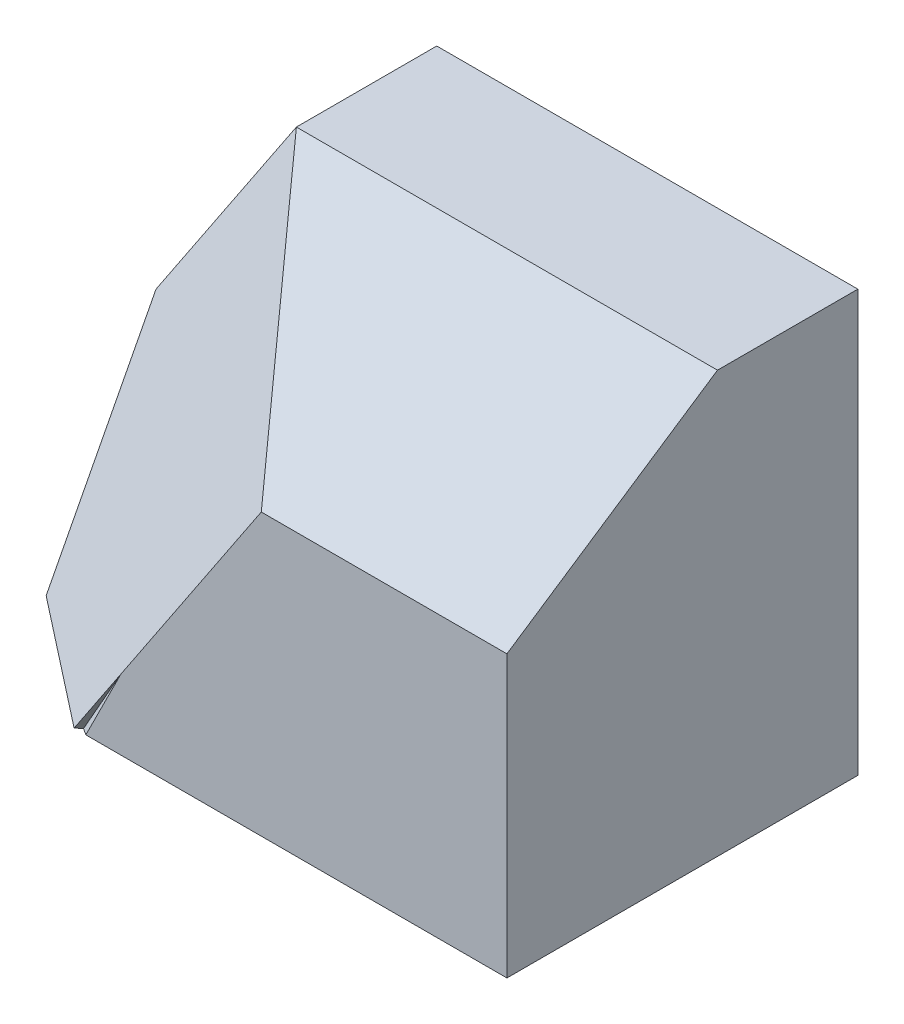
ISO-10303-21;
HEADER;
FILE_DESCRIPTION(('STEP AP214'),'2;1');
FILE_NAME('part.step','',(''),(''),'','','');
FILE_SCHEMA(('AUTOMOTIVE_DESIGN { 1 0 10303 214 1 1 1 1 }'));
ENDSEC;
DATA;
#1=APPLICATION_CONTEXT('core data for automotive mechanical design processes');
#2=APPLICATION_PROTOCOL_DEFINITION('international standard','automotive_design',2000,#1);
#3=PRODUCT_CONTEXT('',#1,'mechanical');
#4=PRODUCT('Part','Part','',(#3));
#5=PRODUCT_RELATED_PRODUCT_CATEGORY('part','',(#4));
#6=PRODUCT_DEFINITION_FORMATION('','',#4);
#7=PRODUCT_DEFINITION_CONTEXT('part definition',#1,'design');
#8=PRODUCT_DEFINITION('design','',#6,#7);
#9=PRODUCT_DEFINITION_SHAPE('','',#8);
#10=(LENGTH_UNIT() NAMED_UNIT(*) SI_UNIT(.MILLI.,.METRE.));
#11=(NAMED_UNIT(*) PLANE_ANGLE_UNIT() SI_UNIT($,.RADIAN.));
#12=(NAMED_UNIT(*) SI_UNIT($,.STERADIAN.) SOLID_ANGLE_UNIT());
#13=UNCERTAINTY_MEASURE_WITH_UNIT(LENGTH_MEASURE(1.E-05),#10,'distance_accuracy_value','');
#14=(GEOMETRIC_REPRESENTATION_CONTEXT(3) GLOBAL_UNCERTAINTY_ASSIGNED_CONTEXT((#13)) GLOBAL_UNIT_ASSIGNED_CONTEXT((#10,
#11,#12)) REPRESENTATION_CONTEXT('',''));
#15=CARTESIAN_POINT('',(0.,0.,0.));
#16=DIRECTION('',(0.,0.,1.));
#17=DIRECTION('',(1.,0.,0.));
#18=AXIS2_PLACEMENT_3D('',#15,#16,#17);
#19=CARTESIAN_POINT('',(21.1836619318213,-1.90021906565861,46.3579134574877));
#20=DIRECTION('',(0.606079835940257,-0.404053223960172,0.685133727584639));
#21=DIRECTION('',(0.74899656249038,0.,-0.662573882203029));
#22=AXIS2_PLACEMENT_3D('',#19,#20,#21);
#23=PLANE('',#22);
#24=DIRECTION('',(0.554700196225229,0.832050294337844,0.));
#25=VECTOR('',#24,1.);
#26=CARTESIAN_POINT('',(18.3333333333333,0.,50.));
#27=LINE('',#26,#25);
#28=CARTESIAN_POINT('',(18.3333333333333,0.,50.));
#29=VERTEX_POINT('',#28);
#30=CARTESIAN_POINT('',(24.9999999999999,9.9999999999998,50.));
#31=VERTEX_POINT('',#30);
#32=EDGE_CURVE('E156',#29,#31,#27,.T.);
#33=ORIENTED_EDGE('',*,*,#32,.F.);
#34=DIRECTION('',(0.74899656249038,0.,-0.662573882203029));
#35=VECTOR('',#34,1.);
#36=CARTESIAN_POINT('',(21.7397979681883,0.,46.9865889768591));
#37=LINE('',#36,#35);
#38=CARTESIAN_POINT('',(19.0495867768595,0.,49.366391184573));
#39=VERTEX_POINT('',#38);
#40=EDGE_CURVE('E158',#29,#39,#37,.T.);
#41=ORIENTED_EDGE('',*,*,#40,.T.);
#42=DIRECTION('',(0.510602628361373,0.858096083773975,0.0543697243162574));
#43=VECTOR('',#42,1.);
#44=CARTESIAN_POINT('',(12.7125965331873,-10.6496641595047,48.6916190752931));
#45=LINE('',#44,#43);
#46=EDGE_CURVE('E153',#39,#31,#45,.T.);
#47=ORIENTED_EDGE('',*,*,#46,.T.);
#48=EDGE_LOOP('',(#33,#41,#47));
#49=FACE_BOUND('',#48,.T.);
#50=ADVANCED_FACE('F35',(#49),#23,.T.);
#51=CARTESIAN_POINT('',(0.,0.,50.));
#52=DIRECTION('',(1.,0.,0.));
#53=DIRECTION('',(0.,0.,-1.));
#54=AXIS2_PLACEMENT_3D('',#51,#52,#53);
#55=PLANE('',#54);
#56=DIRECTION('',(0.,0.,-1.));
#57=VECTOR('',#56,1.);
#58=CARTESIAN_POINT('',(0.,0.,50.));
#59=LINE('',#58,#57);
#60=CARTESIAN_POINT('',(0.,0.,35.6521739130435));
#61=VERTEX_POINT('',#60);
#62=CARTESIAN_POINT('',(0.,0.,0.));
#63=VERTEX_POINT('',#62);
#64=EDGE_CURVE('E130',#61,#63,#59,.T.);
#65=ORIENTED_EDGE('',*,*,#64,.F.);
#66=DIRECTION('',(0.,0.886584846165455,-0.46256600669502));
#67=VECTOR('',#66,1.);
#68=CARTESIAN_POINT('',(0.,-5.88410104011887,38.7221396731055));
#69=LINE('',#68,#67);
#70=CARTESIAN_POINT('',(0.,30.,20.));
#71=VERTEX_POINT('',#70);
#72=EDGE_CURVE('E147',#61,#71,#69,.T.);
#73=ORIENTED_EDGE('',*,*,#72,.T.);
#74=DIRECTION('',(0.,0.,1.));
#75=VECTOR('',#74,1.);
#76=CARTESIAN_POINT('',(0.,30.,0.));
#77=LINE('',#76,#75);
#78=CARTESIAN_POINT('',(0.,30.,0.));
#79=VERTEX_POINT('',#78);
#80=EDGE_CURVE('E129',#79,#71,#77,.T.);
#81=ORIENTED_EDGE('',*,*,#80,.F.);
#82=DIRECTION('',(0.,-1.,0.));
#83=VECTOR('',#82,1.);
#84=CARTESIAN_POINT('',(0.,0.,0.));
#85=LINE('',#84,#83);
#86=EDGE_CURVE('E107',#79,#63,#85,.T.);
#87=ORIENTED_EDGE('',*,*,#86,.T.);
#88=EDGE_LOOP('',(#65,#73,#81,#87));
#89=FACE_BOUND('',#88,.T.);
#90=ADVANCED_FACE('F185',(#89),#55,.F.);
#91=CARTESIAN_POINT('',(-15.7142857142857,7.85714285714286,23.5714285714286));
#92=DIRECTION('',(-0.534522483824849,0.267261241912424,0.801783725737273));
#93=DIRECTION('',(0.832050294337844,0.,0.554700196225229));
#94=AXIS2_PLACEMENT_3D('',#91,#92,#93);
#95=PLANE('',#94);
#96=ORIENTED_EDGE('',*,*,#46,.F.);
#97=DIRECTION('',(-0.832050294337844,0.,-0.554700196225229));
#98=VECTOR('',#97,1.);
#99=CARTESIAN_POINT('',(6.15384615384614,0.,40.7692307692308));
#100=LINE('',#99,#98);
#101=CARTESIAN_POINT('',(20.,0.,50.));
#102=VERTEX_POINT('',#101);
#103=EDGE_CURVE('E133',#102,#39,#100,.T.);
#104=ORIENTED_EDGE('',*,*,#103,.F.);
#105=DIRECTION('',(-0.447213595499958,-0.894427190999916,0.));
#106=VECTOR('',#105,1.);
#107=CARTESIAN_POINT('',(16.,-7.99999999999999,50.));
#108=LINE('',#107,#106);
#109=EDGE_CURVE('E131',#31,#102,#108,.T.);
#110=ORIENTED_EDGE('',*,*,#109,.F.);
#111=EDGE_LOOP('',(#96,#104,#110));
#112=FACE_BOUND('',#111,.T.);
#113=ADVANCED_FACE('F172',(#112),#95,.T.);
#114=CARTESIAN_POINT('',(0.,0.,50.));
#115=DIRECTION('',(0.,1.,0.));
#116=DIRECTION('',(0.,0.,1.));
#117=AXIS2_PLACEMENT_3D('',#114,#115,#116);
#118=PLANE('',#117);
#119=DIRECTION('',(-0.787505001007586,0.,-0.616308261658111));
#120=VECTOR('',#119,1.);
#121=CARTESIAN_POINT('',(6.96365767878078,0.,41.1019929660023));
#122=LINE('',#121,#120);
#123=EDGE_CURVE('E150',#29,#61,#122,.T.);
#124=ORIENTED_EDGE('',*,*,#123,.T.);
#125=ORIENTED_EDGE('',*,*,#64,.T.);
#126=DIRECTION('',(1.,0.,0.));
#127=VECTOR('',#126,1.);
#128=CARTESIAN_POINT('',(0.,0.,0.));
#129=LINE('',#128,#127);
#130=CARTESIAN_POINT('',(80.,0.,0.));
#131=VERTEX_POINT('',#130);
#132=EDGE_CURVE('E127',#63,#131,#129,.T.);
#133=ORIENTED_EDGE('',*,*,#132,.T.);
#134=DIRECTION('',(0.,0.,-1.));
#135=VECTOR('',#134,1.);
#136=CARTESIAN_POINT('',(80.,0.,50.));
#137=LINE('',#136,#135);
#138=CARTESIAN_POINT('',(80.,0.,50.));
#139=VERTEX_POINT('',#138);
#140=EDGE_CURVE('E118',#139,#131,#137,.T.);
#141=ORIENTED_EDGE('',*,*,#140,.F.);
#142=DIRECTION('',(1.,0.,0.));
#143=VECTOR('',#142,1.);
#144=CARTESIAN_POINT('',(0.,0.,50.));
#145=LINE('',#144,#143);
#146=EDGE_CURVE('E138',#102,#139,#145,.T.);
#147=ORIENTED_EDGE('',*,*,#146,.F.);
#148=ORIENTED_EDGE('',*,*,#103,.T.);
#149=ORIENTED_EDGE('',*,*,#40,.F.);
#150=EDGE_LOOP('',(#124,#125,#133,#141,#147,#148,#149));
#151=FACE_BOUND('',#150,.T.);
#152=ADVANCED_FACE('F174',(#151),#118,.F.);
#153=CARTESIAN_POINT('',(0.,30.,0.));
#154=DIRECTION('',(0.832050294337843,-0.554700196225229,0.));
#155=DIRECTION('',(0.554700196225229,0.832050294337844,0.));
#156=AXIS2_PLACEMENT_3D('',#153,#154,#155);
#157=PLANE('',#156);
#158=ORIENTED_EDGE('',*,*,#80,.T.);
#159=DIRECTION('',(-0.554700196225229,-0.832050294337844,0.));
#160=VECTOR('',#159,1.);
#161=CARTESIAN_POINT('',(0.,30.,20.));
#162=LINE('',#161,#160);
#163=CARTESIAN_POINT('',(20.,60.,20.));
#164=VERTEX_POINT('',#163);
#165=EDGE_CURVE('E94',#164,#71,#162,.T.);
#166=ORIENTED_EDGE('',*,*,#165,.F.);
#167=DIRECTION('',(0.,0.,1.));
#168=VECTOR('',#167,1.);
#169=CARTESIAN_POINT('',(20.,60.,0.));
#170=LINE('',#169,#168);
#171=CARTESIAN_POINT('',(20.,60.,0.));
#172=VERTEX_POINT('',#171);
#173=EDGE_CURVE('E39',#172,#164,#170,.T.);
#174=ORIENTED_EDGE('',*,*,#173,.F.);
#175=DIRECTION('',(0.554700196225229,0.832050294337844,0.));
#176=VECTOR('',#175,1.);
#177=CARTESIAN_POINT('',(0.,30.,0.));
#178=LINE('',#177,#176);
#179=EDGE_CURVE('E44',#79,#172,#178,.T.);
#180=ORIENTED_EDGE('',*,*,#179,.F.);
#181=EDGE_LOOP('',(#158,#166,#174,#180));
#182=FACE_BOUND('',#181,.T.);
#183=ADVANCED_FACE('F37',(#182),#157,.F.);
#184=CARTESIAN_POINT('',(0.,0.,50.));
#185=DIRECTION('',(0.,0.,-1.));
#186=DIRECTION('',(-1.,0.,0.));
#187=AXIS2_PLACEMENT_3D('',#184,#185,#186);
#188=PLANE('',#187);
#189=DIRECTION('',(1.,0.,0.));
#190=VECTOR('',#189,1.);
#191=CARTESIAN_POINT('',(-44.,40.,50.));
#192=LINE('',#191,#190);
#193=CARTESIAN_POINT('',(45.,40.,50.));
#194=VERTEX_POINT('',#193);
#195=CARTESIAN_POINT('',(80.,40.,50.));
#196=VERTEX_POINT('',#195);
#197=EDGE_CURVE('E11',#194,#196,#192,.T.);
#198=ORIENTED_EDGE('',*,*,#197,.F.);
#199=DIRECTION('',(0.554700196225229,0.832050294337844,0.));
#200=VECTOR('',#199,1.);
#201=CARTESIAN_POINT('',(45.,40.,50.));
#202=LINE('',#201,#200);
#203=EDGE_CURVE('E52',#31,#194,#202,.T.);
#204=ORIENTED_EDGE('',*,*,#203,.F.);
#205=ORIENTED_EDGE('',*,*,#109,.T.);
#206=ORIENTED_EDGE('',*,*,#146,.T.);
#207=DIRECTION('',(0.,1.,0.));
#208=VECTOR('',#207,1.);
#209=CARTESIAN_POINT('',(80.,0.,50.));
#210=LINE('',#209,#208);
#211=EDGE_CURVE('E121',#139,#196,#210,.T.);
#212=ORIENTED_EDGE('',*,*,#211,.T.);
#213=EDGE_LOOP('',(#198,#204,#205,#206,#212));
#214=FACE_BOUND('',#213,.T.);
#215=ADVANCED_FACE('F177',(#214),#188,.F.);
#216=CARTESIAN_POINT('',(80.,0.,50.));
#217=DIRECTION('',(-1.,0.,0.));
#218=DIRECTION('',(0.,0.,1.));
#219=AXIS2_PLACEMENT_3D('',#216,#217,#218);
#220=PLANE('',#219);
#221=DIRECTION('',(0.,0.,-1.));
#222=VECTOR('',#221,1.);
#223=CARTESIAN_POINT('',(80.,60.,50.));
#224=LINE('',#223,#222);
#225=CARTESIAN_POINT('',(80.,60.,20.));
#226=VERTEX_POINT('',#225);
#227=CARTESIAN_POINT('',(80.,60.,0.));
#228=VERTEX_POINT('',#227);
#229=EDGE_CURVE('E111',#226,#228,#224,.T.);
#230=ORIENTED_EDGE('',*,*,#229,.F.);
#231=DIRECTION('',(0.,-0.554700196225229,0.832050294337844));
#232=VECTOR('',#231,1.);
#233=CARTESIAN_POINT('',(80.,60.,20.));
#234=LINE('',#233,#232);
#235=EDGE_CURVE('E60',#226,#196,#234,.T.);
#236=ORIENTED_EDGE('',*,*,#235,.T.);
#237=ORIENTED_EDGE('',*,*,#211,.F.);
#238=ORIENTED_EDGE('',*,*,#140,.T.);
#239=DIRECTION('',(0.,1.,0.));
#240=VECTOR('',#239,1.);
#241=CARTESIAN_POINT('',(80.,0.,0.));
#242=LINE('',#241,#240);
#243=EDGE_CURVE('E98',#131,#228,#242,.T.);
#244=ORIENTED_EDGE('',*,*,#243,.T.);
#245=EDGE_LOOP('',(#230,#236,#237,#238,#244));
#246=FACE_BOUND('',#245,.T.);
#247=ADVANCED_FACE('F123',(#246),#220,.F.);
#248=CARTESIAN_POINT('',(0.,60.,50.));
#249=DIRECTION('',(0.,-1.,0.));
#250=DIRECTION('',(0.,0.,-1.));
#251=AXIS2_PLACEMENT_3D('',#248,#249,#250);
#252=PLANE('',#251);
#253=ORIENTED_EDGE('',*,*,#173,.T.);
#254=DIRECTION('',(1.,0.,0.));
#255=VECTOR('',#254,1.);
#256=CARTESIAN_POINT('',(20.,60.,20.));
#257=LINE('',#256,#255);
#258=EDGE_CURVE('E97',#164,#226,#257,.T.);
#259=ORIENTED_EDGE('',*,*,#258,.T.);
#260=ORIENTED_EDGE('',*,*,#229,.T.);
#261=DIRECTION('',(-1.,0.,0.));
#262=VECTOR('',#261,1.);
#263=CARTESIAN_POINT('',(0.,60.,0.));
#264=LINE('',#263,#262);
#265=EDGE_CURVE('E104',#228,#172,#264,.T.);
#266=ORIENTED_EDGE('',*,*,#265,.T.);
#267=EDGE_LOOP('',(#253,#259,#260,#266));
#268=FACE_BOUND('',#267,.T.);
#269=ADVANCED_FACE('F109',(#268),#252,.F.);
#270=CARTESIAN_POINT('',(0.,0.,0.));
#271=DIRECTION('',(0.,0.,-1.));
#272=DIRECTION('',(-1.,0.,0.));
#273=AXIS2_PLACEMENT_3D('',#270,#271,#272);
#274=PLANE('',#273);
#275=ORIENTED_EDGE('',*,*,#179,.T.);
#276=ORIENTED_EDGE('',*,*,#265,.F.);
#277=ORIENTED_EDGE('',*,*,#243,.F.);
#278=ORIENTED_EDGE('',*,*,#132,.F.);
#279=ORIENTED_EDGE('',*,*,#86,.F.);
#280=EDGE_LOOP('',(#275,#276,#277,#278,#279));
#281=FACE_BOUND('',#280,.T.);
#282=ADVANCED_FACE('F102',(#281),#274,.T.);
#283=CARTESIAN_POINT('',(0.,50.7692307692308,33.8461538461539));
#284=DIRECTION('',(0.,-0.832050294337843,-0.554700196225229));
#285=DIRECTION('',(0.,0.554700196225229,-0.832050294337843));
#286=AXIS2_PLACEMENT_3D('',#283,#284,#285);
#287=PLANE('',#286);
#288=ORIENTED_EDGE('',*,*,#258,.F.);
#289=DIRECTION('',(-0.56980288229819,0.455842305838552,-0.683763458757828));
#290=VECTOR('',#289,1.);
#291=CARTESIAN_POINT('',(20.,60.,20.));
#292=LINE('',#291,#290);
#293=EDGE_CURVE('E137',#194,#164,#292,.T.);
#294=ORIENTED_EDGE('',*,*,#293,.F.);
#295=ORIENTED_EDGE('',*,*,#197,.T.);
#296=ORIENTED_EDGE('',*,*,#235,.F.);
#297=EDGE_LOOP('',(#288,#294,#295,#296));
#298=FACE_BOUND('',#297,.T.);
#299=ADVANCED_FACE('F188',(#298),#287,.F.);
#300=CARTESIAN_POINT('',(-14.8044132397192,9.86960882647943,18.9167502507523));
#301=DIRECTION('',(0.570065719697583,-0.380043813131722,-0.728417308502467));
#302=DIRECTION('',(-0.787505001007586,0.,-0.61630826165811));
#303=AXIS2_PLACEMENT_3D('',#300,#301,#302);
#304=PLANE('',#303);
#305=ORIENTED_EDGE('',*,*,#123,.F.);
#306=ORIENTED_EDGE('',*,*,#32,.T.);
#307=ORIENTED_EDGE('',*,*,#203,.T.);
#308=ORIENTED_EDGE('',*,*,#293,.T.);
#309=ORIENTED_EDGE('',*,*,#165,.T.);
#310=ORIENTED_EDGE('',*,*,#72,.F.);
#311=EDGE_LOOP('',(#305,#306,#307,#308,#309,#310));
#312=FACE_BOUND('',#311,.T.);
#313=ADVANCED_FACE('F186',(#312),#304,.F.);
#314=CLOSED_SHELL('',(#50,#90,#113,#152,#183,#215,#247,#269,#282,#299,#313));
#315=MANIFOLD_SOLID_BREP('B2',#314);
#316=ADVANCED_BREP_SHAPE_REPRESENTATION('',(#18,#315),#14);
#317=SHAPE_DEFINITION_REPRESENTATION(#9,#316);
ENDSEC;
END-ISO-10303-21;
